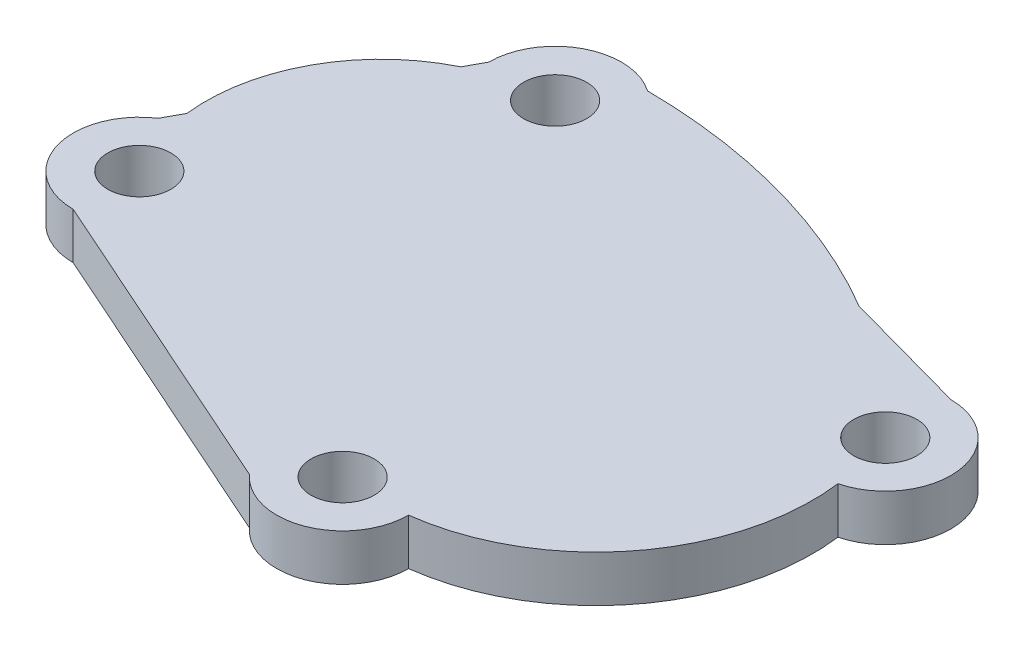
ISO-10303-21;
HEADER;
FILE_DESCRIPTION(('STEP AP214'),'2;1');
FILE_NAME('part.step','',(''),(''),'','','');
FILE_SCHEMA(('AUTOMOTIVE_DESIGN { 1 0 10303 214 1 1 1 1 }'));
ENDSEC;
DATA;
#1=APPLICATION_CONTEXT('core data for automotive mechanical design processes');
#2=APPLICATION_PROTOCOL_DEFINITION('international standard','automotive_design',2000,#1);
#3=PRODUCT_CONTEXT('',#1,'mechanical');
#4=PRODUCT('Part','Part','',(#3));
#5=PRODUCT_RELATED_PRODUCT_CATEGORY('part','',(#4));
#6=PRODUCT_DEFINITION_FORMATION('','',#4);
#7=PRODUCT_DEFINITION_CONTEXT('part definition',#1,'design');
#8=PRODUCT_DEFINITION('design','',#6,#7);
#9=PRODUCT_DEFINITION_SHAPE('','',#8);
#10=(LENGTH_UNIT() NAMED_UNIT(*) SI_UNIT(.MILLI.,.METRE.));
#11=(NAMED_UNIT(*) PLANE_ANGLE_UNIT() SI_UNIT($,.RADIAN.));
#12=(NAMED_UNIT(*) SI_UNIT($,.STERADIAN.) SOLID_ANGLE_UNIT());
#13=UNCERTAINTY_MEASURE_WITH_UNIT(LENGTH_MEASURE(1.E-05),#10,'distance_accuracy_value','');
#14=(GEOMETRIC_REPRESENTATION_CONTEXT(3) GLOBAL_UNCERTAINTY_ASSIGNED_CONTEXT((#13)) GLOBAL_UNIT_ASSIGNED_CONTEXT((#10,
#11,#12)) REPRESENTATION_CONTEXT('',''));
#15=CARTESIAN_POINT('',(0.,0.,0.));
#16=DIRECTION('',(0.,0.,1.));
#17=DIRECTION('',(1.,0.,0.));
#18=AXIS2_PLACEMENT_3D('',#15,#16,#17);
#19=CARTESIAN_POINT('',(20.1035695832761,6.35,-36.8760964584157));
#20=DIRECTION('',(0.,1.,0.));
#21=DIRECTION('',(0.,0.,1.));
#22=AXIS2_PLACEMENT_3D('',#19,#20,#21);
#23=PLANE('',#22);
#24=CARTESIAN_POINT('',(50.2408302276814,6.35,22.3798788654741));
#25=DIRECTION('',(0.,1.,0.));
#26=DIRECTION('',(0.,0.,1.));
#27=AXIS2_PLACEMENT_3D('',#24,#25,#26);
#28=CIRCLE('',#27,4.325);
#29=CARTESIAN_POINT('',(50.2408302276814,6.35,26.7048788654741));
#30=VERTEX_POINT('',#29);
#31=EDGE_CURVE('E285',#30,#30,#28,.T.);
#32=ORIENTED_EDGE('',*,*,#31,.F.);
#33=EDGE_LOOP('',(#32));
#34=FACE_BOUND('',#33,.T.);
#35=CARTESIAN_POINT('',(20.1035695832761,6.35,-36.8760964584157));
#36=DIRECTION('',(0.,1.,0.));
#37=DIRECTION('',(0.,0.,1.));
#38=AXIS2_PLACEMENT_3D('',#35,#36,#37);
#39=CIRCLE('',#38,4.325);
#40=CARTESIAN_POINT('',(20.1035695832761,6.35,-32.5510964584157));
#41=VERTEX_POINT('',#40);
#42=EDGE_CURVE('E131',#41,#41,#39,.T.);
#43=ORIENTED_EDGE('',*,*,#42,.F.);
#44=EDGE_LOOP('',(#43));
#45=FACE_BOUND('',#44,.T.);
#46=CARTESIAN_POINT('',(20.1035695832761,6.35,-36.8760964584157));
#47=DIRECTION('',(0.,1.,0.));
#48=DIRECTION('',(0.,0.,1.));
#49=AXIS2_PLACEMENT_3D('',#46,#47,#48);
#50=CIRCLE('',#49,9.10101359596388);
#51=CARTESIAN_POINT('',(25.3023131679705,6.35,-44.346137530225));
#52=VERTEX_POINT('',#51);
#53=CARTESIAN_POINT('',(11.0025559873122,6.35,-36.8760964584157));
#54=VERTEX_POINT('',#53);
#55=EDGE_CURVE('E155',#52,#54,#50,.T.);
#56=ORIENTED_EDGE('',*,*,#55,.T.);
#57=DIRECTION('',(-0.478656418649431,0.,0.878002296628945));
#58=VECTOR('',#57,1.);
#59=CARTESIAN_POINT('',(11.0025559873122,6.35,-36.8760964584157));
#60=LINE('',#59,#58);
#61=CARTESIAN_POINT('',(9.65906751426341,6.35,-34.4117276149775));
#62=VERTEX_POINT('',#61);
#63=EDGE_CURVE('E126',#54,#62,#60,.T.);
#64=ORIENTED_EDGE('',*,*,#63,.T.);
#65=CARTESIAN_POINT('',(20.2532496099653,6.35,-12.8765632152543));
#66=DIRECTION('',(0.,1.,0.));
#67=DIRECTION('',(0.,0.,1.));
#68=AXIS2_PLACEMENT_3D('',#65,#66,#67);
#69=CIRCLE('',#68,24.);
#70=CARTESIAN_POINT('',(-3.58722286750457,6.35,-10.1139789086675));
#71=VERTEX_POINT('',#70);
#72=EDGE_CURVE('E158',#62,#71,#69,.T.);
#73=ORIENTED_EDGE('',*,*,#72,.T.);
#74=DIRECTION('',(-0.47865641864943,0.,0.878002296628945));
#75=VECTOR('',#74,1.);
#76=CARTESIAN_POINT('',(-3.58722286750457,6.35,-10.1139789086675));
#77=LINE('',#76,#75);
#78=CARTESIAN_POINT('',(-4.97699818790651,6.35,-7.56470582766695));
#79=VERTEX_POINT('',#78);
#80=EDGE_CURVE('E160',#71,#79,#77,.T.);
#81=ORIENTED_EDGE('',*,*,#80,.T.);
#82=CARTESIAN_POINT('',(0.,6.35,0.));
#83=DIRECTION('',(0.,1.,0.));
#84=DIRECTION('',(0.,0.,1.));
#85=AXIS2_PLACEMENT_3D('',#82,#83,#84);
#86=CIRCLE('',#85,9.05512480430629);
#87=CARTESIAN_POINT('',(0.,6.35,9.05512480430629));
#88=VERTEX_POINT('',#87);
#89=EDGE_CURVE('E162',#79,#88,#86,.T.);
#90=ORIENTED_EDGE('',*,*,#89,.T.);
#91=DIRECTION('',(0.913469640503298,0.,0.406906888463165));
#92=VECTOR('',#91,1.);
#93=CARTESIAN_POINT('',(0.,6.35,9.05512480430629));
#94=LINE('',#93,#92);
#95=CARTESIAN_POINT('',(43.5502826234717,6.35,28.4546857839624));
#96=VERTEX_POINT('',#95);
#97=EDGE_CURVE('E164',#88,#96,#94,.T.);
#98=ORIENTED_EDGE('',*,*,#97,.T.);
#99=CARTESIAN_POINT('',(50.2408302276814,6.35,22.3798788654741));
#100=DIRECTION('',(0.,1.,0.));
#101=DIRECTION('',(0.,0.,1.));
#102=AXIS2_PLACEMENT_3D('',#99,#100,#101);
#103=CIRCLE('',#102,9.03696333627124);
#104=CARTESIAN_POINT('',(59.2777935639526,6.35,22.3798788654741));
#105=VERTEX_POINT('',#104);
#106=EDGE_CURVE('E166',#96,#105,#103,.T.);
#107=ORIENTED_EDGE('',*,*,#106,.T.);
#108=CARTESIAN_POINT('',(55.5475886269806,6.35,-7.0417105715285));
#109=DIRECTION('',(0.,1.,0.));
#110=DIRECTION('',(0.,0.,-1.));
#111=AXIS2_PLACEMENT_3D('',#108,#109,#110);
#112=CIRCLE('',#111,29.6571130400677);
#113=CARTESIAN_POINT('',(84.9691780639832,6.35,-10.7719155085005));
#114=VERTEX_POINT('',#113);
#115=EDGE_CURVE('E168',#105,#114,#112,.T.);
#116=ORIENTED_EDGE('',*,*,#115,.T.);
#117=CARTESIAN_POINT('',(82.7352961358223,6.35,-19.4902738133097));
#118=DIRECTION('',(0.,1.,0.));
#119=DIRECTION('',(0.,0.,1.));
#120=AXIS2_PLACEMENT_3D('',#117,#118,#119);
#121=CIRCLE('',#120,8.99999999999999);
#122=CARTESIAN_POINT('',(82.7352961358223,6.35,-28.4902738133097));
#123=VERTEX_POINT('',#122);
#124=EDGE_CURVE('E170',#114,#123,#121,.T.);
#125=ORIENTED_EDGE('',*,*,#124,.T.);
#126=DIRECTION('',(-0.963939754113003,0.,-0.266120556215718));
#127=VECTOR('',#126,1.);
#128=CARTESIAN_POINT('',(65.3666467847543,6.35,-33.285339694035));
#129=LINE('',#128,#127);
#130=CARTESIAN_POINT('',(65.3666467847543,6.35,-33.285339694035));
#131=VERTEX_POINT('',#130);
#132=EDGE_CURVE('E49',#123,#131,#129,.T.);
#133=ORIENTED_EDGE('',*,*,#132,.T.);
#134=CARTESIAN_POINT('',(24.7756947343707,6.35,35.6521291574064));
#135=DIRECTION('',(0.,1.,0.));
#136=DIRECTION('',(0.,0.,-1.));
#137=AXIS2_PLACEMENT_3D('',#134,#135,#136);
#138=CIRCLE('',#137,80.);
#139=EDGE_CURVE('E44',#131,#52,#138,.T.);
#140=ORIENTED_EDGE('',*,*,#139,.T.);
#141=EDGE_LOOP('',(#56,#64,#73,#81,#90,#98,#107,#116,#125,#133,#140));
#142=FACE_BOUND('',#141,.T.);
#143=CARTESIAN_POINT('',(0.,6.35,0.));
#144=DIRECTION('',(0.,1.,0.));
#145=DIRECTION('',(0.,0.,1.));
#146=AXIS2_PLACEMENT_3D('',#143,#144,#145);
#147=CIRCLE('',#146,4.325);
#148=CARTESIAN_POINT('',(0.,6.35,4.325));
#149=VERTEX_POINT('',#148);
#150=EDGE_CURVE('E291',#149,#149,#147,.T.);
#151=ORIENTED_EDGE('',*,*,#150,.F.);
#152=EDGE_LOOP('',(#151));
#153=FACE_BOUND('',#152,.T.);
#154=CARTESIAN_POINT('',(82.7352961358223,6.35,-19.4902738133097));
#155=DIRECTION('',(0.,1.,0.));
#156=DIRECTION('',(0.,0.,1.));
#157=AXIS2_PLACEMENT_3D('',#154,#155,#156);
#158=CIRCLE('',#157,4.325);
#159=CARTESIAN_POINT('',(82.7352961358223,6.35,-15.1652738133097));
#160=VERTEX_POINT('',#159);
#161=EDGE_CURVE('E274',#160,#160,#158,.T.);
#162=ORIENTED_EDGE('',*,*,#161,.F.);
#163=EDGE_LOOP('',(#162));
#164=FACE_BOUND('',#163,.T.);
#165=ADVANCED_FACE('F29',(#34,#45,#142,#153,#164),#23,.T.);
#166=CARTESIAN_POINT('',(20.1035695832761,0.,-36.8760964584157));
#167=DIRECTION('',(0.,1.,0.));
#168=DIRECTION('',(0.,0.,1.));
#169=AXIS2_PLACEMENT_3D('',#166,#167,#168);
#170=PLANE('',#169);
#171=CARTESIAN_POINT('',(50.2408302276814,0.,22.3798788654741));
#172=DIRECTION('',(0.,1.,0.));
#173=DIRECTION('',(0.,0.,1.));
#174=AXIS2_PLACEMENT_3D('',#171,#172,#173);
#175=CIRCLE('',#174,4.325);
#176=CARTESIAN_POINT('',(50.2408302276814,0.,26.7048788654741));
#177=VERTEX_POINT('',#176);
#178=EDGE_CURVE('E280',#177,#177,#175,.T.);
#179=ORIENTED_EDGE('',*,*,#178,.T.);
#180=EDGE_LOOP('',(#179));
#181=FACE_BOUND('',#180,.T.);
#182=CARTESIAN_POINT('',(20.1035695832761,0.,-36.8760964584157));
#183=DIRECTION('',(0.,1.,0.));
#184=DIRECTION('',(0.,0.,1.));
#185=AXIS2_PLACEMENT_3D('',#182,#183,#184);
#186=CIRCLE('',#185,4.325);
#187=CARTESIAN_POINT('',(20.1035695832761,0.,-32.5510964584157));
#188=VERTEX_POINT('',#187);
#189=EDGE_CURVE('E134',#188,#188,#186,.T.);
#190=ORIENTED_EDGE('',*,*,#189,.T.);
#191=EDGE_LOOP('',(#190));
#192=FACE_BOUND('',#191,.T.);
#193=CARTESIAN_POINT('',(20.1035695832761,0.,-36.8760964584157));
#194=DIRECTION('',(0.,1.,0.));
#195=DIRECTION('',(0.,0.,1.));
#196=AXIS2_PLACEMENT_3D('',#193,#194,#195);
#197=CIRCLE('',#196,9.10101359596388);
#198=CARTESIAN_POINT('',(25.3023131679705,0.,-44.346137530225));
#199=VERTEX_POINT('',#198);
#200=CARTESIAN_POINT('',(11.0025559873122,0.,-36.8760964584157));
#201=VERTEX_POINT('',#200);
#202=EDGE_CURVE('E117',#199,#201,#197,.T.);
#203=ORIENTED_EDGE('',*,*,#202,.F.);
#204=CARTESIAN_POINT('',(24.7756947343707,0.,35.6521291574064));
#205=DIRECTION('',(0.,1.,0.));
#206=DIRECTION('',(0.,0.,-1.));
#207=AXIS2_PLACEMENT_3D('',#204,#205,#206);
#208=CIRCLE('',#207,80.);
#209=CARTESIAN_POINT('',(65.3666467847543,0.,-33.285339694035));
#210=VERTEX_POINT('',#209);
#211=EDGE_CURVE('E153',#210,#199,#208,.T.);
#212=ORIENTED_EDGE('',*,*,#211,.F.);
#213=DIRECTION('',(-0.963939754113003,0.,-0.266120556215718));
#214=VECTOR('',#213,1.);
#215=CARTESIAN_POINT('',(65.3666467847543,0.,-33.285339694035));
#216=LINE('',#215,#214);
#217=CARTESIAN_POINT('',(82.7352961358223,0.,-28.4902738133097));
#218=VERTEX_POINT('',#217);
#219=EDGE_CURVE('E151',#218,#210,#216,.T.);
#220=ORIENTED_EDGE('',*,*,#219,.F.);
#221=CARTESIAN_POINT('',(82.7352961358223,0.,-19.4902738133097));
#222=DIRECTION('',(0.,1.,0.));
#223=DIRECTION('',(0.,0.,1.));
#224=AXIS2_PLACEMENT_3D('',#221,#222,#223);
#225=CIRCLE('',#224,8.99999999999999);
#226=CARTESIAN_POINT('',(84.9691780639832,0.,-10.7719155085005));
#227=VERTEX_POINT('',#226);
#228=EDGE_CURVE('E149',#227,#218,#225,.T.);
#229=ORIENTED_EDGE('',*,*,#228,.F.);
#230=CARTESIAN_POINT('',(55.5475886269806,0.,-7.0417105715285));
#231=DIRECTION('',(0.,1.,0.));
#232=DIRECTION('',(0.,0.,-1.));
#233=AXIS2_PLACEMENT_3D('',#230,#231,#232);
#234=CIRCLE('',#233,29.6571130400677);
#235=CARTESIAN_POINT('',(59.2777935639526,0.,22.3798788654741));
#236=VERTEX_POINT('',#235);
#237=EDGE_CURVE('E147',#236,#227,#234,.T.);
#238=ORIENTED_EDGE('',*,*,#237,.F.);
#239=CARTESIAN_POINT('',(50.2408302276814,0.,22.3798788654741));
#240=DIRECTION('',(0.,1.,0.));
#241=DIRECTION('',(0.,0.,1.));
#242=AXIS2_PLACEMENT_3D('',#239,#240,#241);
#243=CIRCLE('',#242,9.03696333627124);
#244=CARTESIAN_POINT('',(43.5502826234717,0.,28.4546857839624));
#245=VERTEX_POINT('',#244);
#246=EDGE_CURVE('E145',#245,#236,#243,.T.);
#247=ORIENTED_EDGE('',*,*,#246,.F.);
#248=DIRECTION('',(0.913469640503298,0.,0.406906888463165));
#249=VECTOR('',#248,1.);
#250=CARTESIAN_POINT('',(0.,0.,9.05512480430629));
#251=LINE('',#250,#249);
#252=CARTESIAN_POINT('',(0.,0.,9.05512480430629));
#253=VERTEX_POINT('',#252);
#254=EDGE_CURVE('E143',#253,#245,#251,.T.);
#255=ORIENTED_EDGE('',*,*,#254,.F.);
#256=CARTESIAN_POINT('',(0.,0.,0.));
#257=DIRECTION('',(0.,1.,0.));
#258=DIRECTION('',(0.,0.,1.));
#259=AXIS2_PLACEMENT_3D('',#256,#257,#258);
#260=CIRCLE('',#259,9.05512480430629);
#261=CARTESIAN_POINT('',(-4.97699818790651,0.,-7.56470582766695));
#262=VERTEX_POINT('',#261);
#263=EDGE_CURVE('E141',#262,#253,#260,.T.);
#264=ORIENTED_EDGE('',*,*,#263,.F.);
#265=DIRECTION('',(-0.47865641864943,0.,0.878002296628945));
#266=VECTOR('',#265,1.);
#267=CARTESIAN_POINT('',(-3.58722286750457,0.,-10.1139789086675));
#268=LINE('',#267,#266);
#269=CARTESIAN_POINT('',(-3.58722286750457,0.,-10.1139789086675));
#270=VERTEX_POINT('',#269);
#271=EDGE_CURVE('E139',#270,#262,#268,.T.);
#272=ORIENTED_EDGE('',*,*,#271,.F.);
#273=CARTESIAN_POINT('',(20.2532496099653,0.,-12.8765632152543));
#274=DIRECTION('',(0.,1.,0.));
#275=DIRECTION('',(0.,0.,1.));
#276=AXIS2_PLACEMENT_3D('',#273,#274,#275);
#277=CIRCLE('',#276,24.);
#278=CARTESIAN_POINT('',(9.65906751426341,0.,-34.4117276149775));
#279=VERTEX_POINT('',#278);
#280=EDGE_CURVE('E119',#279,#270,#277,.T.);
#281=ORIENTED_EDGE('',*,*,#280,.F.);
#282=DIRECTION('',(-0.478656418649431,0.,0.878002296628945));
#283=VECTOR('',#282,1.);
#284=CARTESIAN_POINT('',(11.0025559873122,0.,-36.8760964584157));
#285=LINE('',#284,#283);
#286=EDGE_CURVE('E112',#201,#279,#285,.T.);
#287=ORIENTED_EDGE('',*,*,#286,.F.);
#288=EDGE_LOOP('',(#203,#212,#220,#229,#238,#247,#255,#264,#272,#281,#287));
#289=FACE_BOUND('',#288,.T.);
#290=CARTESIAN_POINT('',(0.,0.,0.));
#291=DIRECTION('',(0.,1.,0.));
#292=DIRECTION('',(0.,0.,1.));
#293=AXIS2_PLACEMENT_3D('',#290,#291,#292);
#294=CIRCLE('',#293,4.325);
#295=CARTESIAN_POINT('',(0.,0.,4.325));
#296=VERTEX_POINT('',#295);
#297=EDGE_CURVE('E288',#296,#296,#294,.T.);
#298=ORIENTED_EDGE('',*,*,#297,.T.);
#299=EDGE_LOOP('',(#298));
#300=FACE_BOUND('',#299,.T.);
#301=CARTESIAN_POINT('',(82.7352961358223,0.,-19.4902738133097));
#302=DIRECTION('',(0.,1.,0.));
#303=DIRECTION('',(0.,0.,1.));
#304=AXIS2_PLACEMENT_3D('',#301,#302,#303);
#305=CIRCLE('',#304,4.325);
#306=CARTESIAN_POINT('',(82.7352961358223,0.,-15.1652738133097));
#307=VERTEX_POINT('',#306);
#308=EDGE_CURVE('E277',#307,#307,#305,.T.);
#309=ORIENTED_EDGE('',*,*,#308,.T.);
#310=EDGE_LOOP('',(#309));
#311=FACE_BOUND('',#310,.T.);
#312=ADVANCED_FACE('F113',(#181,#192,#289,#300,#311),#170,.F.);
#313=CARTESIAN_POINT('',(20.1035695832761,6.35,-36.8760964584157));
#314=DIRECTION('',(0.,-1.,0.));
#315=DIRECTION('',(0.,0.,-1.));
#316=AXIS2_PLACEMENT_3D('',#313,#314,#315);
#317=CYLINDRICAL_SURFACE('',#316,9.10101359596388);
#318=ORIENTED_EDGE('',*,*,#202,.T.);
#319=DIRECTION('',(0.,-1.,0.));
#320=VECTOR('',#319,1.);
#321=CARTESIAN_POINT('',(11.0025559873122,6.35,-36.8760964584157));
#322=LINE('',#321,#320);
#323=EDGE_CURVE('E11',#54,#201,#322,.T.);
#324=ORIENTED_EDGE('',*,*,#323,.F.);
#325=ORIENTED_EDGE('',*,*,#55,.F.);
#326=DIRECTION('',(0.,-1.,0.));
#327=VECTOR('',#326,1.);
#328=CARTESIAN_POINT('',(25.3023131679705,6.35,-44.346137530225));
#329=LINE('',#328,#327);
#330=EDGE_CURVE('E130',#52,#199,#329,.T.);
#331=ORIENTED_EDGE('',*,*,#330,.T.);
#332=EDGE_LOOP('',(#318,#324,#325,#331));
#333=FACE_BOUND('',#332,.T.);
#334=ADVANCED_FACE('F31',(#333),#317,.T.);
#335=CARTESIAN_POINT('',(11.0025559873122,6.35,-36.8760964584157));
#336=DIRECTION('',(0.878002296628944,0.,0.47865641864943));
#337=DIRECTION('',(0.478656418649431,0.,-0.878002296628945));
#338=AXIS2_PLACEMENT_3D('',#335,#336,#337);
#339=PLANE('',#338);
#340=ORIENTED_EDGE('',*,*,#286,.T.);
#341=DIRECTION('',(0.,-1.,0.));
#342=VECTOR('',#341,1.);
#343=CARTESIAN_POINT('',(9.65906751426341,6.35,-34.4117276149775));
#344=LINE('',#343,#342);
#345=EDGE_CURVE('E37',#62,#279,#344,.T.);
#346=ORIENTED_EDGE('',*,*,#345,.F.);
#347=ORIENTED_EDGE('',*,*,#63,.F.);
#348=ORIENTED_EDGE('',*,*,#323,.T.);
#349=EDGE_LOOP('',(#340,#346,#347,#348));
#350=FACE_BOUND('',#349,.T.);
#351=ADVANCED_FACE('F125',(#350),#339,.F.);
#352=CARTESIAN_POINT('',(20.2532496099653,6.35,-12.8765632152543));
#353=DIRECTION('',(0.,-1.,0.));
#354=DIRECTION('',(0.,0.,-1.));
#355=AXIS2_PLACEMENT_3D('',#352,#353,#354);
#356=CYLINDRICAL_SURFACE('',#355,24.);
#357=ORIENTED_EDGE('',*,*,#280,.T.);
#358=DIRECTION('',(0.,-1.,0.));
#359=VECTOR('',#358,1.);
#360=CARTESIAN_POINT('',(-3.58722286750457,6.35,-10.1139789086675));
#361=LINE('',#360,#359);
#362=EDGE_CURVE('E196',#71,#270,#361,.T.);
#363=ORIENTED_EDGE('',*,*,#362,.F.);
#364=ORIENTED_EDGE('',*,*,#72,.F.);
#365=ORIENTED_EDGE('',*,*,#345,.T.);
#366=EDGE_LOOP('',(#357,#363,#364,#365));
#367=FACE_BOUND('',#366,.T.);
#368=ADVANCED_FACE('F200',(#367),#356,.T.);
#369=CARTESIAN_POINT('',(-3.58722286750457,6.35,-10.1139789086675));
#370=DIRECTION('',(0.878002296628945,0.,0.47865641864943));
#371=DIRECTION('',(0.47865641864943,0.,-0.878002296628945));
#372=AXIS2_PLACEMENT_3D('',#369,#370,#371);
#373=PLANE('',#372);
#374=ORIENTED_EDGE('',*,*,#271,.T.);
#375=DIRECTION('',(0.,-1.,0.));
#376=VECTOR('',#375,1.);
#377=CARTESIAN_POINT('',(-4.97699818790651,6.35,-7.56470582766695));
#378=LINE('',#377,#376);
#379=EDGE_CURVE('E193',#79,#262,#378,.T.);
#380=ORIENTED_EDGE('',*,*,#379,.F.);
#381=ORIENTED_EDGE('',*,*,#80,.F.);
#382=ORIENTED_EDGE('',*,*,#362,.T.);
#383=EDGE_LOOP('',(#374,#380,#381,#382));
#384=FACE_BOUND('',#383,.T.);
#385=ADVANCED_FACE('F208',(#384),#373,.F.);
#386=CARTESIAN_POINT('',(0.,6.35,0.));
#387=DIRECTION('',(0.,-1.,0.));
#388=DIRECTION('',(0.,0.,-1.));
#389=AXIS2_PLACEMENT_3D('',#386,#387,#388);
#390=CYLINDRICAL_SURFACE('',#389,9.05512480430629);
#391=ORIENTED_EDGE('',*,*,#263,.T.);
#392=DIRECTION('',(0.,-1.,0.));
#393=VECTOR('',#392,1.);
#394=CARTESIAN_POINT('',(0.,6.35,9.05512480430629));
#395=LINE('',#394,#393);
#396=EDGE_CURVE('E190',#88,#253,#395,.T.);
#397=ORIENTED_EDGE('',*,*,#396,.F.);
#398=ORIENTED_EDGE('',*,*,#89,.F.);
#399=ORIENTED_EDGE('',*,*,#379,.T.);
#400=EDGE_LOOP('',(#391,#397,#398,#399));
#401=FACE_BOUND('',#400,.T.);
#402=ADVANCED_FACE('F211',(#401),#390,.T.);
#403=CARTESIAN_POINT('',(0.,6.35,9.05512480430629));
#404=DIRECTION('',(0.406906888463165,0.,-0.913469640503298));
#405=DIRECTION('',(-0.913469640503298,0.,-0.406906888463166));
#406=AXIS2_PLACEMENT_3D('',#403,#404,#405);
#407=PLANE('',#406);
#408=ORIENTED_EDGE('',*,*,#254,.T.);
#409=DIRECTION('',(0.,-1.,0.));
#410=VECTOR('',#409,1.);
#411=CARTESIAN_POINT('',(43.5502826234717,6.35,28.4546857839624));
#412=LINE('',#411,#410);
#413=EDGE_CURVE('E187',#96,#245,#412,.T.);
#414=ORIENTED_EDGE('',*,*,#413,.F.);
#415=ORIENTED_EDGE('',*,*,#97,.F.);
#416=ORIENTED_EDGE('',*,*,#396,.T.);
#417=EDGE_LOOP('',(#408,#414,#415,#416));
#418=FACE_BOUND('',#417,.T.);
#419=ADVANCED_FACE('F216',(#418),#407,.F.);
#420=CARTESIAN_POINT('',(50.2408302276814,6.35,22.3798788654741));
#421=DIRECTION('',(0.,-1.,0.));
#422=DIRECTION('',(0.,0.,-1.));
#423=AXIS2_PLACEMENT_3D('',#420,#421,#422);
#424=CYLINDRICAL_SURFACE('',#423,9.03696333627124);
#425=ORIENTED_EDGE('',*,*,#246,.T.);
#426=DIRECTION('',(0.,-1.,0.));
#427=VECTOR('',#426,1.);
#428=CARTESIAN_POINT('',(59.2777935639526,6.35,22.3798788654741));
#429=LINE('',#428,#427);
#430=EDGE_CURVE('E184',#105,#236,#429,.T.);
#431=ORIENTED_EDGE('',*,*,#430,.F.);
#432=ORIENTED_EDGE('',*,*,#106,.F.);
#433=ORIENTED_EDGE('',*,*,#413,.T.);
#434=EDGE_LOOP('',(#425,#431,#432,#433));
#435=FACE_BOUND('',#434,.T.);
#436=ADVANCED_FACE('F222',(#435),#424,.T.);
#437=CARTESIAN_POINT('',(55.5475886269806,6.35,-7.0417105715285));
#438=DIRECTION('',(0.,-1.,0.));
#439=DIRECTION('',(0.,0.,-1.));
#440=AXIS2_PLACEMENT_3D('',#437,#438,#439);
#441=CYLINDRICAL_SURFACE('',#440,29.6571130400677);
#442=ORIENTED_EDGE('',*,*,#237,.T.);
#443=DIRECTION('',(0.,-1.,0.));
#444=VECTOR('',#443,1.);
#445=CARTESIAN_POINT('',(84.9691780639832,6.35,-10.7719155085005));
#446=LINE('',#445,#444);
#447=EDGE_CURVE('E181',#114,#227,#446,.T.);
#448=ORIENTED_EDGE('',*,*,#447,.F.);
#449=ORIENTED_EDGE('',*,*,#115,.F.);
#450=ORIENTED_EDGE('',*,*,#430,.T.);
#451=EDGE_LOOP('',(#442,#448,#449,#450));
#452=FACE_BOUND('',#451,.T.);
#453=ADVANCED_FACE('F226',(#452),#441,.T.);
#454=CARTESIAN_POINT('',(82.7352961358223,6.35,-19.4902738133097));
#455=DIRECTION('',(0.,-1.,0.));
#456=DIRECTION('',(0.,0.,-1.));
#457=AXIS2_PLACEMENT_3D('',#454,#455,#456);
#458=CYLINDRICAL_SURFACE('',#457,8.99999999999999);
#459=ORIENTED_EDGE('',*,*,#228,.T.);
#460=DIRECTION('',(0.,-1.,0.));
#461=VECTOR('',#460,1.);
#462=CARTESIAN_POINT('',(82.7352961358223,6.35,-28.4902738133097));
#463=LINE('',#462,#461);
#464=EDGE_CURVE('E178',#123,#218,#463,.T.);
#465=ORIENTED_EDGE('',*,*,#464,.F.);
#466=ORIENTED_EDGE('',*,*,#124,.F.);
#467=ORIENTED_EDGE('',*,*,#447,.T.);
#468=EDGE_LOOP('',(#459,#465,#466,#467));
#469=FACE_BOUND('',#468,.T.);
#470=ADVANCED_FACE('F231',(#469),#458,.T.);
#471=CARTESIAN_POINT('',(65.3666467847543,6.35,-33.285339694035));
#472=DIRECTION('',(-0.266120556215718,0.,0.963939754113003));
#473=DIRECTION('',(0.963939754113003,0.,0.266120556215718));
#474=AXIS2_PLACEMENT_3D('',#471,#472,#473);
#475=PLANE('',#474);
#476=ORIENTED_EDGE('',*,*,#219,.T.);
#477=DIRECTION('',(0.,-1.,0.));
#478=VECTOR('',#477,1.);
#479=CARTESIAN_POINT('',(65.3666467847543,6.35,-33.285339694035));
#480=LINE('',#479,#478);
#481=EDGE_CURVE('E175',#131,#210,#480,.T.);
#482=ORIENTED_EDGE('',*,*,#481,.F.);
#483=ORIENTED_EDGE('',*,*,#132,.F.);
#484=ORIENTED_EDGE('',*,*,#464,.T.);
#485=EDGE_LOOP('',(#476,#482,#483,#484));
#486=FACE_BOUND('',#485,.T.);
#487=ADVANCED_FACE('F234',(#486),#475,.F.);
#488=CARTESIAN_POINT('',(24.7756947343707,6.35,35.6521291574064));
#489=DIRECTION('',(0.,-1.,0.));
#490=DIRECTION('',(0.,0.,-1.));
#491=AXIS2_PLACEMENT_3D('',#488,#489,#490);
#492=CYLINDRICAL_SURFACE('',#491,80.);
#493=ORIENTED_EDGE('',*,*,#211,.T.);
#494=ORIENTED_EDGE('',*,*,#330,.F.);
#495=ORIENTED_EDGE('',*,*,#139,.F.);
#496=ORIENTED_EDGE('',*,*,#481,.T.);
#497=EDGE_LOOP('',(#493,#494,#495,#496));
#498=FACE_BOUND('',#497,.T.);
#499=ADVANCED_FACE('F236',(#498),#492,.T.);
#500=CARTESIAN_POINT('',(20.1035695832761,6.35,-36.8760964584157));
#501=DIRECTION('',(0.,-1.,0.));
#502=DIRECTION('',(0.,0.,-1.));
#503=AXIS2_PLACEMENT_3D('',#500,#501,#502);
#504=CYLINDRICAL_SURFACE('',#503,4.325);
#505=ORIENTED_EDGE('',*,*,#42,.T.);
#506=EDGE_LOOP('',(#505));
#507=FACE_BOUND('',#506,.T.);
#508=ORIENTED_EDGE('',*,*,#189,.F.);
#509=EDGE_LOOP('',(#508));
#510=FACE_BOUND('',#509,.T.);
#511=ADVANCED_FACE('F238',(#507,#510),#504,.F.);
#512=CARTESIAN_POINT('',(0.,6.35,0.));
#513=DIRECTION('',(0.,-1.,0.));
#514=DIRECTION('',(0.,0.,-1.));
#515=AXIS2_PLACEMENT_3D('',#512,#513,#514);
#516=CYLINDRICAL_SURFACE('',#515,4.325);
#517=ORIENTED_EDGE('',*,*,#150,.T.);
#518=EDGE_LOOP('',(#517));
#519=FACE_BOUND('',#518,.T.);
#520=ORIENTED_EDGE('',*,*,#297,.F.);
#521=EDGE_LOOP('',(#520));
#522=FACE_BOUND('',#521,.T.);
#523=ADVANCED_FACE('F244',(#519,#522),#516,.F.);
#524=CARTESIAN_POINT('',(50.2408302276814,6.35,22.3798788654741));
#525=DIRECTION('',(0.,-1.,0.));
#526=DIRECTION('',(0.,0.,-1.));
#527=AXIS2_PLACEMENT_3D('',#524,#525,#526);
#528=CYLINDRICAL_SURFACE('',#527,4.325);
#529=ORIENTED_EDGE('',*,*,#31,.T.);
#530=EDGE_LOOP('',(#529));
#531=FACE_BOUND('',#530,.T.);
#532=ORIENTED_EDGE('',*,*,#178,.F.);
#533=EDGE_LOOP('',(#532));
#534=FACE_BOUND('',#533,.T.);
#535=ADVANCED_FACE('F261',(#531,#534),#528,.F.);
#536=CARTESIAN_POINT('',(82.7352961358223,6.35,-19.4902738133097));
#537=DIRECTION('',(0.,-1.,0.));
#538=DIRECTION('',(0.,0.,-1.));
#539=AXIS2_PLACEMENT_3D('',#536,#537,#538);
#540=CYLINDRICAL_SURFACE('',#539,4.325);
#541=ORIENTED_EDGE('',*,*,#161,.T.);
#542=EDGE_LOOP('',(#541));
#543=FACE_BOUND('',#542,.T.);
#544=ORIENTED_EDGE('',*,*,#308,.F.);
#545=EDGE_LOOP('',(#544));
#546=FACE_BOUND('',#545,.T.);
#547=ADVANCED_FACE('F265',(#543,#546),#540,.F.);
#548=CLOSED_SHELL('',(#165,#312,#334,#351,#368,#385,#402,#419,#436,#453,#470,#487,#499,#511,
#523,#535,#547));
#549=MANIFOLD_SOLID_BREP('B2',#548);
#550=ADVANCED_BREP_SHAPE_REPRESENTATION('',(#18,#549),#14);
#551=SHAPE_DEFINITION_REPRESENTATION(#9,#550);
ENDSEC;
END-ISO-10303-21;
